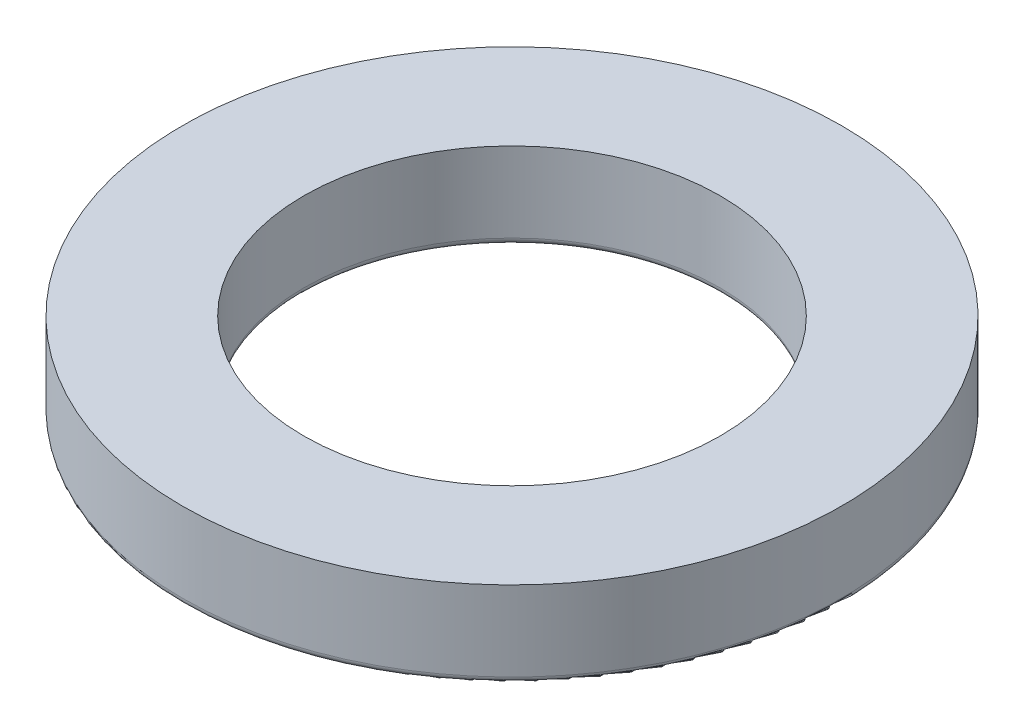
ISO-10303-21;
HEADER;
FILE_DESCRIPTION(('STEP AP214'),'2;1');
FILE_NAME('part.step','',(''),(''),'','','');
FILE_SCHEMA(('AUTOMOTIVE_DESIGN { 1 0 10303 214 1 1 1 1 }'));
ENDSEC;
DATA;
#1=APPLICATION_CONTEXT('core data for automotive mechanical design processes');
#2=APPLICATION_PROTOCOL_DEFINITION('international standard','automotive_design',2000,#1);
#3=PRODUCT_CONTEXT('',#1,'mechanical');
#4=PRODUCT('Part','Part','',(#3));
#5=PRODUCT_RELATED_PRODUCT_CATEGORY('part','',(#4));
#6=PRODUCT_DEFINITION_FORMATION('','',#4);
#7=PRODUCT_DEFINITION_CONTEXT('part definition',#1,'design');
#8=PRODUCT_DEFINITION('design','',#6,#7);
#9=PRODUCT_DEFINITION_SHAPE('','',#8);
#10=(LENGTH_UNIT() NAMED_UNIT(*) SI_UNIT(.MILLI.,.METRE.));
#11=(NAMED_UNIT(*) PLANE_ANGLE_UNIT() SI_UNIT($,.RADIAN.));
#12=(NAMED_UNIT(*) SI_UNIT($,.STERADIAN.) SOLID_ANGLE_UNIT());
#13=UNCERTAINTY_MEASURE_WITH_UNIT(LENGTH_MEASURE(1.E-05),#10,'distance_accuracy_value','');
#14=(GEOMETRIC_REPRESENTATION_CONTEXT(3) GLOBAL_UNCERTAINTY_ASSIGNED_CONTEXT((#13)) GLOBAL_UNIT_ASSIGNED_CONTEXT((#10,
#11,#12)) REPRESENTATION_CONTEXT('',''));
#15=CARTESIAN_POINT('',(0.,0.,0.));
#16=DIRECTION('',(0.,0.,1.));
#17=DIRECTION('',(1.,0.,0.));
#18=AXIS2_PLACEMENT_3D('',#15,#16,#17);
#19=CARTESIAN_POINT('',(0.,2.5,0.));
#20=DIRECTION('',(0.,1.,0.));
#21=DIRECTION('',(0.,0.,1.));
#22=AXIS2_PLACEMENT_3D('',#19,#20,#21);
#23=PLANE('',#22);
#24=CARTESIAN_POINT('',(0.,2.5,0.));
#25=DIRECTION('',(0.,1.,0.));
#26=DIRECTION('',(0.,0.,1.));
#27=AXIS2_PLACEMENT_3D('',#24,#25,#26);
#28=CIRCLE('',#27,9.5);
#29=CARTESIAN_POINT('',(0.,2.5,9.5));
#30=VERTEX_POINT('',#29);
#31=EDGE_CURVE('E65',#30,#30,#28,.T.);
#32=ORIENTED_EDGE('',*,*,#31,.T.);
#33=EDGE_LOOP('',(#32));
#34=FACE_BOUND('',#33,.T.);
#35=CARTESIAN_POINT('',(0.,2.5,0.));
#36=DIRECTION('',(0.,1.,0.));
#37=DIRECTION('',(0.,0.,1.));
#38=AXIS2_PLACEMENT_3D('',#35,#36,#37);
#39=CIRCLE('',#38,6.);
#40=CARTESIAN_POINT('',(0.,2.5,6.));
#41=VERTEX_POINT('',#40);
#42=EDGE_CURVE('E69',#41,#41,#39,.T.);
#43=ORIENTED_EDGE('',*,*,#42,.F.);
#44=EDGE_LOOP('',(#43));
#45=FACE_BOUND('',#44,.T.);
#46=ADVANCED_FACE('F41',(#34,#45),#23,.T.);
#47=CARTESIAN_POINT('',(0.,0.,0.));
#48=DIRECTION('',(0.,1.,0.));
#49=DIRECTION('',(0.,0.,1.));
#50=AXIS2_PLACEMENT_3D('',#47,#48,#49);
#51=PLANE('',#50);
#52=CARTESIAN_POINT('',(0.,0.,0.));
#53=DIRECTION('',(0.,1.,0.));
#54=DIRECTION('',(0.,0.,1.));
#55=AXIS2_PLACEMENT_3D('',#52,#53,#54);
#56=CIRCLE('',#55,6.2);
#57=CARTESIAN_POINT('',(0.,0.,6.2));
#58=VERTEX_POINT('',#57);
#59=EDGE_CURVE('E54',#58,#58,#56,.T.);
#60=ORIENTED_EDGE('',*,*,#59,.T.);
#61=EDGE_LOOP('',(#60));
#62=FACE_BOUND('',#61,.T.);
#63=CARTESIAN_POINT('',(0.,0.,0.));
#64=DIRECTION('',(0.,1.,0.));
#65=DIRECTION('',(0.,0.,1.));
#66=AXIS2_PLACEMENT_3D('',#63,#64,#65);
#67=CIRCLE('',#66,9.3);
#68=CARTESIAN_POINT('',(0.,0.,9.3));
#69=VERTEX_POINT('',#68);
#70=EDGE_CURVE('E59',#69,#69,#67,.F.);
#71=ORIENTED_EDGE('',*,*,#70,.T.);
#72=EDGE_LOOP('',(#71));
#73=FACE_BOUND('',#72,.T.);
#74=ADVANCED_FACE('F77',(#62,#73),#51,.F.);
#75=CARTESIAN_POINT('',(0.,2.5,0.));
#76=DIRECTION('',(0.,-1.,0.));
#77=DIRECTION('',(0.,0.,-1.));
#78=AXIS2_PLACEMENT_3D('',#75,#76,#77);
#79=CYLINDRICAL_SURFACE('',#78,9.5);
#80=CARTESIAN_POINT('',(0.,0.2,0.));
#81=DIRECTION('',(0.,1.,0.));
#82=DIRECTION('',(0.,0.,1.));
#83=AXIS2_PLACEMENT_3D('',#80,#81,#82);
#84=CIRCLE('',#83,9.5);
#85=CARTESIAN_POINT('',(0.,0.2,9.5));
#86=VERTEX_POINT('',#85);
#87=EDGE_CURVE('E10',#86,#86,#84,.T.);
#88=ORIENTED_EDGE('',*,*,#87,.T.);
#89=EDGE_LOOP('',(#88));
#90=FACE_BOUND('',#89,.T.);
#91=ORIENTED_EDGE('',*,*,#31,.F.);
#92=EDGE_LOOP('',(#91));
#93=FACE_BOUND('',#92,.T.);
#94=ADVANCED_FACE('F83',(#90,#93),#79,.T.);
#95=CARTESIAN_POINT('',(0.,2.5,0.));
#96=DIRECTION('',(0.,-1.,0.));
#97=DIRECTION('',(0.,0.,-1.));
#98=AXIS2_PLACEMENT_3D('',#95,#96,#97);
#99=CYLINDRICAL_SURFACE('',#98,6.);
#100=CARTESIAN_POINT('',(0.,0.2,0.));
#101=DIRECTION('',(0.,1.,0.));
#102=DIRECTION('',(0.,0.,1.));
#103=AXIS2_PLACEMENT_3D('',#100,#101,#102);
#104=CIRCLE('',#103,6.);
#105=CARTESIAN_POINT('',(0.,0.2,6.));
#106=VERTEX_POINT('',#105);
#107=EDGE_CURVE('E49',#106,#106,#104,.F.);
#108=ORIENTED_EDGE('',*,*,#107,.T.);
#109=EDGE_LOOP('',(#108));
#110=FACE_BOUND('',#109,.T.);
#111=ORIENTED_EDGE('',*,*,#42,.T.);
#112=EDGE_LOOP('',(#111));
#113=FACE_BOUND('',#112,.T.);
#114=ADVANCED_FACE('F74',(#110,#113),#99,.F.);
#115=CARTESIAN_POINT('',(0.,0.2,0.));
#116=DIRECTION('',(0.,1.,0.));
#117=DIRECTION('',(0.,0.,1.));
#118=AXIS2_PLACEMENT_3D('',#115,#116,#117);
#119=TOROIDAL_SURFACE('',#118,6.2,0.2);
#120=ORIENTED_EDGE('',*,*,#107,.F.);
#121=EDGE_LOOP('',(#120));
#122=FACE_BOUND('',#121,.T.);
#123=ORIENTED_EDGE('',*,*,#59,.F.);
#124=EDGE_LOOP('',(#123));
#125=FACE_BOUND('',#124,.T.);
#126=ADVANCED_FACE('F89',(#122,#125),#119,.T.);
#127=CARTESIAN_POINT('',(0.,0.2,0.));
#128=DIRECTION('',(0.,1.,0.));
#129=DIRECTION('',(0.,0.,1.));
#130=AXIS2_PLACEMENT_3D('',#127,#128,#129);
#131=TOROIDAL_SURFACE('',#130,9.3,0.2);
#132=ORIENTED_EDGE('',*,*,#70,.F.);
#133=EDGE_LOOP('',(#132));
#134=FACE_BOUND('',#133,.T.);
#135=ORIENTED_EDGE('',*,*,#87,.F.);
#136=EDGE_LOOP('',(#135));
#137=FACE_BOUND('',#136,.T.);
#138=ADVANCED_FACE('F43',(#134,#137),#131,.T.);
#139=CLOSED_SHELL('',(#46,#74,#94,#114,#126,#138));
#140=MANIFOLD_SOLID_BREP('B2',#139);
#141=ADVANCED_BREP_SHAPE_REPRESENTATION('',(#18,#140),#14);
#142=SHAPE_DEFINITION_REPRESENTATION(#9,#141);
ENDSEC;
END-ISO-10303-21;
